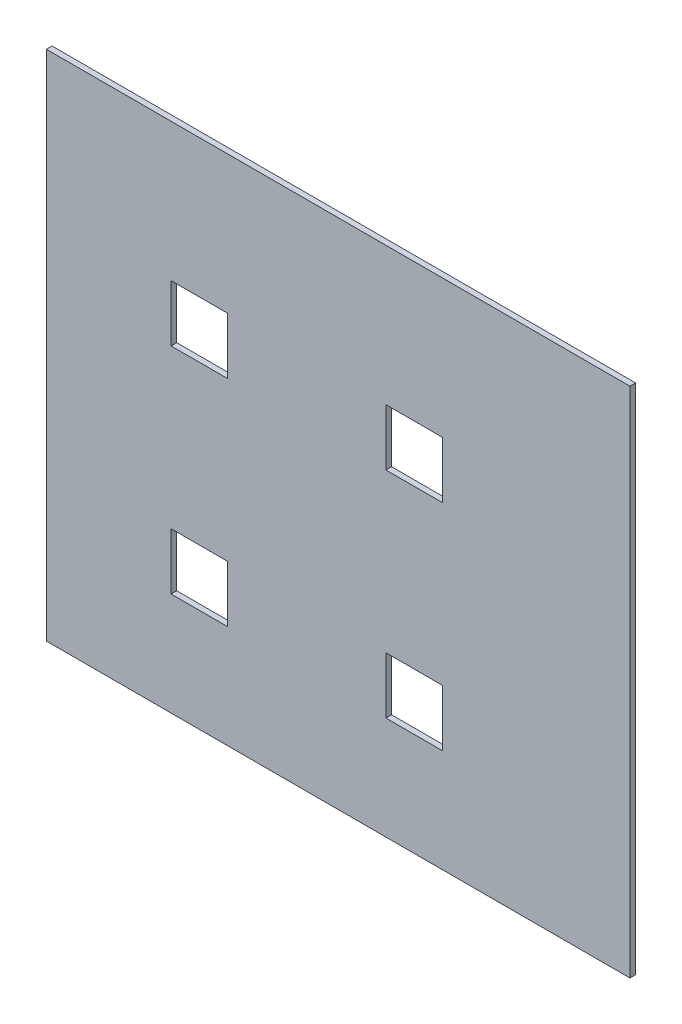
ISO-10303-21;
HEADER;
FILE_DESCRIPTION(('STEP AP214'),'2;1');
FILE_NAME('part.step','',(''),(''),'','','');
FILE_SCHEMA(('AUTOMOTIVE_DESIGN { 1 0 10303 214 1 1 1 1 }'));
ENDSEC;
DATA;
#1=APPLICATION_CONTEXT('core data for automotive mechanical design processes');
#2=APPLICATION_PROTOCOL_DEFINITION('international standard','automotive_design',2000,#1);
#3=PRODUCT_CONTEXT('',#1,'mechanical');
#4=PRODUCT('Part','Part','',(#3));
#5=PRODUCT_RELATED_PRODUCT_CATEGORY('part','',(#4));
#6=PRODUCT_DEFINITION_FORMATION('','',#4);
#7=PRODUCT_DEFINITION_CONTEXT('part definition',#1,'design');
#8=PRODUCT_DEFINITION('design','',#6,#7);
#9=PRODUCT_DEFINITION_SHAPE('','',#8);
#10=(LENGTH_UNIT() NAMED_UNIT(*) SI_UNIT(.MILLI.,.METRE.));
#11=(NAMED_UNIT(*) PLANE_ANGLE_UNIT() SI_UNIT($,.RADIAN.));
#12=(NAMED_UNIT(*) SI_UNIT($,.STERADIAN.) SOLID_ANGLE_UNIT());
#13=UNCERTAINTY_MEASURE_WITH_UNIT(LENGTH_MEASURE(1.E-05),#10,'distance_accuracy_value','');
#14=(GEOMETRIC_REPRESENTATION_CONTEXT(3) GLOBAL_UNCERTAINTY_ASSIGNED_CONTEXT((#13)) GLOBAL_UNIT_ASSIGNED_CONTEXT((#10,
#11,#12)) REPRESENTATION_CONTEXT('',''));
#15=CARTESIAN_POINT('',(0.,0.,0.));
#16=DIRECTION('',(0.,0.,1.));
#17=DIRECTION('',(1.,0.,0.));
#18=AXIS2_PLACEMENT_3D('',#15,#16,#17);
#19=CARTESIAN_POINT('',(0.,0.,1.));
#20=DIRECTION('',(0.,0.,1.));
#21=DIRECTION('',(1.,0.,0.));
#22=AXIS2_PLACEMENT_3D('',#19,#20,#21);
#23=PLANE('',#22);
#24=DIRECTION('',(0.,-1.,0.));
#25=VECTOR('',#24,1.);
#26=CARTESIAN_POINT('',(-22.0490408347482,72.417950797242,1.));
#27=LINE('',#26,#25);
#28=CARTESIAN_POINT('',(-22.0490408347482,72.417950797242,1.));
#29=VERTEX_POINT('',#28);
#30=CARTESIAN_POINT('',(-22.0490408347482,-18.2372017055102,1.));
#31=VERTEX_POINT('',#30);
#32=EDGE_CURVE('E299',#29,#31,#27,.T.);
#33=ORIENTED_EDGE('',*,*,#32,.T.);
#34=DIRECTION('',(1.,0.,0.));
#35=VECTOR('',#34,1.);
#36=CARTESIAN_POINT('',(-22.0490408347482,-18.2372017055102,1.));
#37=LINE('',#36,#35);
#38=CARTESIAN_POINT('',(81.1644011921947,-18.2372017055102,1.));
#39=VERTEX_POINT('',#38);
#40=EDGE_CURVE('E302',#31,#39,#37,.T.);
#41=ORIENTED_EDGE('',*,*,#40,.T.);
#42=DIRECTION('',(0.,1.,0.));
#43=VECTOR('',#42,1.);
#44=CARTESIAN_POINT('',(81.1644011921947,72.417950797242,1.));
#45=LINE('',#44,#43);
#46=CARTESIAN_POINT('',(81.1644011921947,72.417950797242,1.));
#47=VERTEX_POINT('',#46);
#48=EDGE_CURVE('E305',#39,#47,#45,.T.);
#49=ORIENTED_EDGE('',*,*,#48,.T.);
#50=DIRECTION('',(-1.,0.,0.));
#51=VECTOR('',#50,1.);
#52=CARTESIAN_POINT('',(-22.0490408347482,72.417950797242,1.));
#53=LINE('',#52,#51);
#54=EDGE_CURVE('E307',#47,#29,#53,.T.);
#55=ORIENTED_EDGE('',*,*,#54,.T.);
#56=EDGE_LOOP('',(#33,#41,#49,#55));
#57=FACE_BOUND('',#56,.T.);
#58=DIRECTION('',(1.,0.,0.));
#59=VECTOR('',#58,1.);
#60=CARTESIAN_POINT('',(0.,0.,1.));
#61=LINE('',#60,#59);
#62=CARTESIAN_POINT('',(0.,0.,1.));
#63=VERTEX_POINT('',#62);
#64=CARTESIAN_POINT('',(10.,0.,1.));
#65=VERTEX_POINT('',#64);
#66=EDGE_CURVE('E270',#63,#65,#61,.T.);
#67=ORIENTED_EDGE('',*,*,#66,.F.);
#68=DIRECTION('',(0.,-1.,0.));
#69=VECTOR('',#68,1.);
#70=CARTESIAN_POINT('',(0.,0.,1.));
#71=LINE('',#70,#69);
#72=CARTESIAN_POINT('',(0.,10.,1.));
#73=VERTEX_POINT('',#72);
#74=EDGE_CURVE('E268',#73,#63,#71,.T.);
#75=ORIENTED_EDGE('',*,*,#74,.F.);
#76=DIRECTION('',(-1.,0.,0.));
#77=VECTOR('',#76,1.);
#78=CARTESIAN_POINT('',(0.,10.,1.));
#79=LINE('',#78,#77);
#80=CARTESIAN_POINT('',(10.,10.,1.));
#81=VERTEX_POINT('',#80);
#82=EDGE_CURVE('E276',#81,#73,#79,.T.);
#83=ORIENTED_EDGE('',*,*,#82,.F.);
#84=DIRECTION('',(0.,1.,0.));
#85=VECTOR('',#84,1.);
#86=CARTESIAN_POINT('',(10.,0.,1.));
#87=LINE('',#86,#85);
#88=EDGE_CURVE('E273',#65,#81,#87,.T.);
#89=ORIENTED_EDGE('',*,*,#88,.F.);
#90=EDGE_LOOP('',(#67,#75,#83,#89));
#91=FACE_BOUND('',#90,.T.);
#92=DIRECTION('',(1.,0.,0.));
#93=VECTOR('',#92,1.);
#94=CARTESIAN_POINT('',(38.,0.,1.));
#95=LINE('',#94,#93);
#96=CARTESIAN_POINT('',(38.,0.,1.));
#97=VERTEX_POINT('',#96);
#98=CARTESIAN_POINT('',(48.,0.,1.));
#99=VERTEX_POINT('',#98);
#100=EDGE_CURVE('E239',#97,#99,#95,.T.);
#101=ORIENTED_EDGE('',*,*,#100,.F.);
#102=DIRECTION('',(0.,-1.,0.));
#103=VECTOR('',#102,1.);
#104=CARTESIAN_POINT('',(38.,0.,1.));
#105=LINE('',#104,#103);
#106=CARTESIAN_POINT('',(38.,10.,1.));
#107=VERTEX_POINT('',#106);
#108=EDGE_CURVE('E237',#107,#97,#105,.T.);
#109=ORIENTED_EDGE('',*,*,#108,.F.);
#110=DIRECTION('',(-1.,0.,0.));
#111=VECTOR('',#110,1.);
#112=CARTESIAN_POINT('',(38.,10.,1.));
#113=LINE('',#112,#111);
#114=CARTESIAN_POINT('',(48.,10.,1.));
#115=VERTEX_POINT('',#114);
#116=EDGE_CURVE('E245',#115,#107,#113,.T.);
#117=ORIENTED_EDGE('',*,*,#116,.F.);
#118=DIRECTION('',(0.,1.,0.));
#119=VECTOR('',#118,1.);
#120=CARTESIAN_POINT('',(48.,0.,1.));
#121=LINE('',#120,#119);
#122=EDGE_CURVE('E242',#99,#115,#121,.T.);
#123=ORIENTED_EDGE('',*,*,#122,.F.);
#124=EDGE_LOOP('',(#101,#109,#117,#123));
#125=FACE_BOUND('',#124,.T.);
#126=DIRECTION('',(1.,0.,0.));
#127=VECTOR('',#126,1.);
#128=CARTESIAN_POINT('',(38.,38.,1.));
#129=LINE('',#128,#127);
#130=CARTESIAN_POINT('',(38.,38.,1.));
#131=VERTEX_POINT('',#130);
#132=CARTESIAN_POINT('',(48.,38.,1.));
#133=VERTEX_POINT('',#132);
#134=EDGE_CURVE('E208',#131,#133,#129,.T.);
#135=ORIENTED_EDGE('',*,*,#134,.F.);
#136=DIRECTION('',(0.,-1.,0.));
#137=VECTOR('',#136,1.);
#138=CARTESIAN_POINT('',(38.,38.,1.));
#139=LINE('',#138,#137);
#140=CARTESIAN_POINT('',(38.,48.,1.));
#141=VERTEX_POINT('',#140);
#142=EDGE_CURVE('E206',#141,#131,#139,.T.);
#143=ORIENTED_EDGE('',*,*,#142,.F.);
#144=DIRECTION('',(-1.,0.,0.));
#145=VECTOR('',#144,1.);
#146=CARTESIAN_POINT('',(38.,48.,1.));
#147=LINE('',#146,#145);
#148=CARTESIAN_POINT('',(48.,48.,1.));
#149=VERTEX_POINT('',#148);
#150=EDGE_CURVE('E214',#149,#141,#147,.T.);
#151=ORIENTED_EDGE('',*,*,#150,.F.);
#152=DIRECTION('',(0.,1.,0.));
#153=VECTOR('',#152,1.);
#154=CARTESIAN_POINT('',(48.,38.,1.));
#155=LINE('',#154,#153);
#156=EDGE_CURVE('E211',#133,#149,#155,.T.);
#157=ORIENTED_EDGE('',*,*,#156,.F.);
#158=EDGE_LOOP('',(#135,#143,#151,#157));
#159=FACE_BOUND('',#158,.T.);
#160=DIRECTION('',(1.,0.,0.));
#161=VECTOR('',#160,1.);
#162=CARTESIAN_POINT('',(0.,38.,1.));
#163=LINE('',#162,#161);
#164=CARTESIAN_POINT('',(0.,38.,1.));
#165=VERTEX_POINT('',#164);
#166=CARTESIAN_POINT('',(10.,38.,1.));
#167=VERTEX_POINT('',#166);
#168=EDGE_CURVE('E178',#165,#167,#163,.T.);
#169=ORIENTED_EDGE('',*,*,#168,.F.);
#170=DIRECTION('',(0.,-1.,0.));
#171=VECTOR('',#170,1.);
#172=CARTESIAN_POINT('',(0.,38.,1.));
#173=LINE('',#172,#171);
#174=CARTESIAN_POINT('',(0.,48.,1.));
#175=VERTEX_POINT('',#174);
#176=EDGE_CURVE('E170',#175,#165,#173,.T.);
#177=ORIENTED_EDGE('',*,*,#176,.F.);
#178=DIRECTION('',(-1.,0.,0.));
#179=VECTOR('',#178,1.);
#180=CARTESIAN_POINT('',(0.,48.,1.));
#181=LINE('',#180,#179);
#182=CARTESIAN_POINT('',(10.,48.,1.));
#183=VERTEX_POINT('',#182);
#184=EDGE_CURVE('E192',#183,#175,#181,.T.);
#185=ORIENTED_EDGE('',*,*,#184,.F.);
#186=DIRECTION('',(0.,1.,0.));
#187=VECTOR('',#186,1.);
#188=CARTESIAN_POINT('',(10.,38.,1.));
#189=LINE('',#188,#187);
#190=EDGE_CURVE('E190',#167,#183,#189,.T.);
#191=ORIENTED_EDGE('',*,*,#190,.F.);
#192=EDGE_LOOP('',(#169,#177,#185,#191));
#193=FACE_BOUND('',#192,.T.);
#194=ADVANCED_FACE('F33',(#57,#91,#125,#159,#193),#23,.T.);
#195=CARTESIAN_POINT('',(0.,0.,0.));
#196=DIRECTION('',(0.,0.,1.));
#197=DIRECTION('',(1.,0.,0.));
#198=AXIS2_PLACEMENT_3D('',#195,#196,#197);
#199=PLANE('',#198);
#200=DIRECTION('',(0.,-1.,0.));
#201=VECTOR('',#200,1.);
#202=CARTESIAN_POINT('',(38.,38.,0.));
#203=LINE('',#202,#201);
#204=CARTESIAN_POINT('',(38.,48.,0.));
#205=VERTEX_POINT('',#204);
#206=CARTESIAN_POINT('',(38.,38.,0.));
#207=VERTEX_POINT('',#206);
#208=EDGE_CURVE('E186',#205,#207,#203,.T.);
#209=ORIENTED_EDGE('',*,*,#208,.T.);
#210=DIRECTION('',(1.,0.,0.));
#211=VECTOR('',#210,1.);
#212=CARTESIAN_POINT('',(38.,38.,0.));
#213=LINE('',#212,#211);
#214=CARTESIAN_POINT('',(48.,38.,0.));
#215=VERTEX_POINT('',#214);
#216=EDGE_CURVE('E219',#207,#215,#213,.T.);
#217=ORIENTED_EDGE('',*,*,#216,.T.);
#218=DIRECTION('',(0.,1.,0.));
#219=VECTOR('',#218,1.);
#220=CARTESIAN_POINT('',(48.,38.,0.));
#221=LINE('',#220,#219);
#222=CARTESIAN_POINT('',(48.,48.,0.));
#223=VERTEX_POINT('',#222);
#224=EDGE_CURVE('E222',#215,#223,#221,.T.);
#225=ORIENTED_EDGE('',*,*,#224,.T.);
#226=DIRECTION('',(-1.,0.,0.));
#227=VECTOR('',#226,1.);
#228=CARTESIAN_POINT('',(38.,48.,0.));
#229=LINE('',#228,#227);
#230=EDGE_CURVE('E209',#223,#205,#229,.T.);
#231=ORIENTED_EDGE('',*,*,#230,.T.);
#232=EDGE_LOOP('',(#209,#217,#225,#231));
#233=FACE_BOUND('',#232,.T.);
#234=DIRECTION('',(0.,-1.,0.));
#235=VECTOR('',#234,1.);
#236=CARTESIAN_POINT('',(0.,0.,0.));
#237=LINE('',#236,#235);
#238=CARTESIAN_POINT('',(0.,10.,0.));
#239=VERTEX_POINT('',#238);
#240=CARTESIAN_POINT('',(0.,0.,0.));
#241=VERTEX_POINT('',#240);
#242=EDGE_CURVE('E267',#239,#241,#237,.T.);
#243=ORIENTED_EDGE('',*,*,#242,.T.);
#244=DIRECTION('',(1.,0.,0.));
#245=VECTOR('',#244,1.);
#246=CARTESIAN_POINT('',(0.,0.,0.));
#247=LINE('',#246,#245);
#248=CARTESIAN_POINT('',(10.,0.,0.));
#249=VERTEX_POINT('',#248);
#250=EDGE_CURVE('E281',#241,#249,#247,.T.);
#251=ORIENTED_EDGE('',*,*,#250,.T.);
#252=DIRECTION('',(0.,1.,0.));
#253=VECTOR('',#252,1.);
#254=CARTESIAN_POINT('',(10.,0.,0.));
#255=LINE('',#254,#253);
#256=CARTESIAN_POINT('',(10.,10.,0.));
#257=VERTEX_POINT('',#256);
#258=EDGE_CURVE('E284',#249,#257,#255,.T.);
#259=ORIENTED_EDGE('',*,*,#258,.T.);
#260=DIRECTION('',(-1.,0.,0.));
#261=VECTOR('',#260,1.);
#262=CARTESIAN_POINT('',(0.,10.,0.));
#263=LINE('',#262,#261);
#264=EDGE_CURVE('E271',#257,#239,#263,.T.);
#265=ORIENTED_EDGE('',*,*,#264,.T.);
#266=EDGE_LOOP('',(#243,#251,#259,#265));
#267=FACE_BOUND('',#266,.T.);
#268=DIRECTION('',(0.,-1.,0.));
#269=VECTOR('',#268,1.);
#270=CARTESIAN_POINT('',(-22.0490408347482,72.417950797242,0.));
#271=LINE('',#270,#269);
#272=CARTESIAN_POINT('',(-22.0490408347482,72.417950797242,0.));
#273=VERTEX_POINT('',#272);
#274=CARTESIAN_POINT('',(-22.0490408347482,-18.2372017055102,0.));
#275=VERTEX_POINT('',#274);
#276=EDGE_CURVE('E298',#273,#275,#271,.T.);
#277=ORIENTED_EDGE('',*,*,#276,.F.);
#278=DIRECTION('',(-1.,0.,0.));
#279=VECTOR('',#278,1.);
#280=CARTESIAN_POINT('',(-22.0490408347482,72.417950797242,0.));
#281=LINE('',#280,#279);
#282=CARTESIAN_POINT('',(81.1644011921947,72.417950797242,0.));
#283=VERTEX_POINT('',#282);
#284=EDGE_CURVE('E303',#283,#273,#281,.T.);
#285=ORIENTED_EDGE('',*,*,#284,.F.);
#286=DIRECTION('',(0.,1.,0.));
#287=VECTOR('',#286,1.);
#288=CARTESIAN_POINT('',(81.1644011921947,72.417950797242,0.));
#289=LINE('',#288,#287);
#290=CARTESIAN_POINT('',(81.1644011921947,-18.2372017055102,0.));
#291=VERTEX_POINT('',#290);
#292=EDGE_CURVE('E314',#291,#283,#289,.T.);
#293=ORIENTED_EDGE('',*,*,#292,.F.);
#294=DIRECTION('',(1.,0.,0.));
#295=VECTOR('',#294,1.);
#296=CARTESIAN_POINT('',(-22.0490408347482,-18.2372017055102,0.));
#297=LINE('',#296,#295);
#298=EDGE_CURVE('E312',#275,#291,#297,.T.);
#299=ORIENTED_EDGE('',*,*,#298,.F.);
#300=EDGE_LOOP('',(#277,#285,#293,#299));
#301=FACE_BOUND('',#300,.T.);
#302=DIRECTION('',(0.,-1.,0.));
#303=VECTOR('',#302,1.);
#304=CARTESIAN_POINT('',(38.,0.,0.));
#305=LINE('',#304,#303);
#306=CARTESIAN_POINT('',(38.,10.,0.));
#307=VERTEX_POINT('',#306);
#308=CARTESIAN_POINT('',(38.,0.,0.));
#309=VERTEX_POINT('',#308);
#310=EDGE_CURVE('E236',#307,#309,#305,.T.);
#311=ORIENTED_EDGE('',*,*,#310,.T.);
#312=DIRECTION('',(1.,0.,0.));
#313=VECTOR('',#312,1.);
#314=CARTESIAN_POINT('',(38.,0.,0.));
#315=LINE('',#314,#313);
#316=CARTESIAN_POINT('',(48.,0.,0.));
#317=VERTEX_POINT('',#316);
#318=EDGE_CURVE('E250',#309,#317,#315,.T.);
#319=ORIENTED_EDGE('',*,*,#318,.T.);
#320=DIRECTION('',(0.,1.,0.));
#321=VECTOR('',#320,1.);
#322=CARTESIAN_POINT('',(48.,0.,0.));
#323=LINE('',#322,#321);
#324=CARTESIAN_POINT('',(48.,10.,0.));
#325=VERTEX_POINT('',#324);
#326=EDGE_CURVE('E253',#317,#325,#323,.T.);
#327=ORIENTED_EDGE('',*,*,#326,.T.);
#328=DIRECTION('',(-1.,0.,0.));
#329=VECTOR('',#328,1.);
#330=CARTESIAN_POINT('',(38.,10.,0.));
#331=LINE('',#330,#329);
#332=EDGE_CURVE('E240',#325,#307,#331,.T.);
#333=ORIENTED_EDGE('',*,*,#332,.T.);
#334=EDGE_LOOP('',(#311,#319,#327,#333));
#335=FACE_BOUND('',#334,.T.);
#336=DIRECTION('',(0.,-1.,0.));
#337=VECTOR('',#336,1.);
#338=CARTESIAN_POINT('',(0.,38.,0.));
#339=LINE('',#338,#337);
#340=CARTESIAN_POINT('',(0.,48.,0.));
#341=VERTEX_POINT('',#340);
#342=CARTESIAN_POINT('',(0.,38.,0.));
#343=VERTEX_POINT('',#342);
#344=EDGE_CURVE('E56',#341,#343,#339,.T.);
#345=ORIENTED_EDGE('',*,*,#344,.T.);
#346=DIRECTION('',(1.,0.,0.));
#347=VECTOR('',#346,1.);
#348=CARTESIAN_POINT('',(0.,38.,0.));
#349=LINE('',#348,#347);
#350=CARTESIAN_POINT('',(10.,38.,0.));
#351=VERTEX_POINT('',#350);
#352=EDGE_CURVE('E185',#343,#351,#349,.T.);
#353=ORIENTED_EDGE('',*,*,#352,.T.);
#354=DIRECTION('',(0.,1.,0.));
#355=VECTOR('',#354,1.);
#356=CARTESIAN_POINT('',(10.,38.,0.));
#357=LINE('',#356,#355);
#358=CARTESIAN_POINT('',(10.,48.,0.));
#359=VERTEX_POINT('',#358);
#360=EDGE_CURVE('E198',#351,#359,#357,.T.);
#361=ORIENTED_EDGE('',*,*,#360,.T.);
#362=DIRECTION('',(-1.,0.,0.));
#363=VECTOR('',#362,1.);
#364=CARTESIAN_POINT('',(0.,48.,0.));
#365=LINE('',#364,#363);
#366=EDGE_CURVE('E179',#359,#341,#365,.T.);
#367=ORIENTED_EDGE('',*,*,#366,.T.);
#368=EDGE_LOOP('',(#345,#353,#361,#367));
#369=FACE_BOUND('',#368,.T.);
#370=ADVANCED_FACE('F332',(#233,#267,#301,#335,#369),#199,.F.);
#371=CARTESIAN_POINT('',(-22.0490408347482,72.417950797242,1.));
#372=DIRECTION('',(1.,0.,0.));
#373=DIRECTION('',(0.,0.,-1.));
#374=AXIS2_PLACEMENT_3D('',#371,#372,#373);
#375=PLANE('',#374);
#376=ORIENTED_EDGE('',*,*,#276,.T.);
#377=DIRECTION('',(0.,0.,-1.));
#378=VECTOR('',#377,1.);
#379=CARTESIAN_POINT('',(-22.0490408347482,-18.2372017055102,1.));
#380=LINE('',#379,#378);
#381=EDGE_CURVE('E11',#31,#275,#380,.T.);
#382=ORIENTED_EDGE('',*,*,#381,.F.);
#383=ORIENTED_EDGE('',*,*,#32,.F.);
#384=DIRECTION('',(0.,0.,-1.));
#385=VECTOR('',#384,1.);
#386=CARTESIAN_POINT('',(-22.0490408347482,72.417950797242,1.));
#387=LINE('',#386,#385);
#388=EDGE_CURVE('E309',#29,#273,#387,.T.);
#389=ORIENTED_EDGE('',*,*,#388,.T.);
#390=EDGE_LOOP('',(#376,#382,#383,#389));
#391=FACE_BOUND('',#390,.T.);
#392=ADVANCED_FACE('F35',(#391),#375,.F.);
#393=CARTESIAN_POINT('',(-22.0490408347482,-18.2372017055102,1.));
#394=DIRECTION('',(0.,1.,0.));
#395=DIRECTION('',(0.,0.,1.));
#396=AXIS2_PLACEMENT_3D('',#393,#394,#395);
#397=PLANE('',#396);
#398=ORIENTED_EDGE('',*,*,#298,.T.);
#399=DIRECTION('',(0.,0.,-1.));
#400=VECTOR('',#399,1.);
#401=CARTESIAN_POINT('',(81.1644011921947,-18.2372017055102,1.));
#402=LINE('',#401,#400);
#403=EDGE_CURVE('E41',#39,#291,#402,.T.);
#404=ORIENTED_EDGE('',*,*,#403,.F.);
#405=ORIENTED_EDGE('',*,*,#40,.F.);
#406=ORIENTED_EDGE('',*,*,#381,.T.);
#407=EDGE_LOOP('',(#398,#404,#405,#406));
#408=FACE_BOUND('',#407,.T.);
#409=ADVANCED_FACE('F343',(#408),#397,.F.);
#410=CARTESIAN_POINT('',(81.1644011921947,72.417950797242,1.));
#411=DIRECTION('',(-1.,0.,0.));
#412=DIRECTION('',(0.,0.,1.));
#413=AXIS2_PLACEMENT_3D('',#410,#411,#412);
#414=PLANE('',#413);
#415=ORIENTED_EDGE('',*,*,#292,.T.);
#416=DIRECTION('',(0.,0.,-1.));
#417=VECTOR('',#416,1.);
#418=CARTESIAN_POINT('',(81.1644011921947,72.417950797242,1.));
#419=LINE('',#418,#417);
#420=EDGE_CURVE('E319',#47,#283,#419,.T.);
#421=ORIENTED_EDGE('',*,*,#420,.F.);
#422=ORIENTED_EDGE('',*,*,#48,.F.);
#423=ORIENTED_EDGE('',*,*,#403,.T.);
#424=EDGE_LOOP('',(#415,#421,#422,#423));
#425=FACE_BOUND('',#424,.T.);
#426=ADVANCED_FACE('F326',(#425),#414,.F.);
#427=CARTESIAN_POINT('',(-22.0490408347482,72.417950797242,1.));
#428=DIRECTION('',(0.,-1.,0.));
#429=DIRECTION('',(0.,0.,-1.));
#430=AXIS2_PLACEMENT_3D('',#427,#428,#429);
#431=PLANE('',#430);
#432=ORIENTED_EDGE('',*,*,#284,.T.);
#433=ORIENTED_EDGE('',*,*,#388,.F.);
#434=ORIENTED_EDGE('',*,*,#54,.F.);
#435=ORIENTED_EDGE('',*,*,#420,.T.);
#436=EDGE_LOOP('',(#432,#433,#434,#435));
#437=FACE_BOUND('',#436,.T.);
#438=ADVANCED_FACE('F336',(#437),#431,.F.);
#439=CARTESIAN_POINT('',(0.,0.,1.));
#440=DIRECTION('',(1.,0.,0.));
#441=DIRECTION('',(0.,0.,-1.));
#442=AXIS2_PLACEMENT_3D('',#439,#440,#441);
#443=PLANE('',#442);
#444=ORIENTED_EDGE('',*,*,#242,.F.);
#445=DIRECTION('',(0.,0.,-1.));
#446=VECTOR('',#445,1.);
#447=CARTESIAN_POINT('',(0.,10.,1.));
#448=LINE('',#447,#446);
#449=EDGE_CURVE('E278',#73,#239,#448,.T.);
#450=ORIENTED_EDGE('',*,*,#449,.F.);
#451=ORIENTED_EDGE('',*,*,#74,.T.);
#452=DIRECTION('',(0.,0.,-1.));
#453=VECTOR('',#452,1.);
#454=CARTESIAN_POINT('',(0.,0.,1.));
#455=LINE('',#454,#453);
#456=EDGE_CURVE('E295',#63,#241,#455,.T.);
#457=ORIENTED_EDGE('',*,*,#456,.T.);
#458=EDGE_LOOP('',(#444,#450,#451,#457));
#459=FACE_BOUND('',#458,.T.);
#460=ADVANCED_FACE('F358',(#459),#443,.T.);
#461=CARTESIAN_POINT('',(0.,0.,1.));
#462=DIRECTION('',(0.,1.,0.));
#463=DIRECTION('',(0.,0.,1.));
#464=AXIS2_PLACEMENT_3D('',#461,#462,#463);
#465=PLANE('',#464);
#466=ORIENTED_EDGE('',*,*,#250,.F.);
#467=ORIENTED_EDGE('',*,*,#456,.F.);
#468=ORIENTED_EDGE('',*,*,#66,.T.);
#469=DIRECTION('',(0.,0.,-1.));
#470=VECTOR('',#469,1.);
#471=CARTESIAN_POINT('',(10.,0.,1.));
#472=LINE('',#471,#470);
#473=EDGE_CURVE('E293',#65,#249,#472,.T.);
#474=ORIENTED_EDGE('',*,*,#473,.T.);
#475=EDGE_LOOP('',(#466,#467,#468,#474));
#476=FACE_BOUND('',#475,.T.);
#477=ADVANCED_FACE('F365',(#476),#465,.T.);
#478=CARTESIAN_POINT('',(10.,0.,1.));
#479=DIRECTION('',(-1.,0.,0.));
#480=DIRECTION('',(0.,0.,1.));
#481=AXIS2_PLACEMENT_3D('',#478,#479,#480);
#482=PLANE('',#481);
#483=ORIENTED_EDGE('',*,*,#258,.F.);
#484=ORIENTED_EDGE('',*,*,#473,.F.);
#485=ORIENTED_EDGE('',*,*,#88,.T.);
#486=DIRECTION('',(0.,0.,-1.));
#487=VECTOR('',#486,1.);
#488=CARTESIAN_POINT('',(10.,10.,1.));
#489=LINE('',#488,#487);
#490=EDGE_CURVE('E291',#81,#257,#489,.T.);
#491=ORIENTED_EDGE('',*,*,#490,.T.);
#492=EDGE_LOOP('',(#483,#484,#485,#491));
#493=FACE_BOUND('',#492,.T.);
#494=ADVANCED_FACE('F370',(#493),#482,.T.);
#495=CARTESIAN_POINT('',(0.,10.,1.));
#496=DIRECTION('',(0.,-1.,0.));
#497=DIRECTION('',(0.,0.,-1.));
#498=AXIS2_PLACEMENT_3D('',#495,#496,#497);
#499=PLANE('',#498);
#500=ORIENTED_EDGE('',*,*,#264,.F.);
#501=ORIENTED_EDGE('',*,*,#490,.F.);
#502=ORIENTED_EDGE('',*,*,#82,.T.);
#503=ORIENTED_EDGE('',*,*,#449,.T.);
#504=EDGE_LOOP('',(#500,#501,#502,#503));
#505=FACE_BOUND('',#504,.T.);
#506=ADVANCED_FACE('F378',(#505),#499,.T.);
#507=CARTESIAN_POINT('',(38.,0.,1.));
#508=DIRECTION('',(1.,0.,0.));
#509=DIRECTION('',(0.,0.,-1.));
#510=AXIS2_PLACEMENT_3D('',#507,#508,#509);
#511=PLANE('',#510);
#512=ORIENTED_EDGE('',*,*,#310,.F.);
#513=DIRECTION('',(0.,0.,-1.));
#514=VECTOR('',#513,1.);
#515=CARTESIAN_POINT('',(38.,10.,1.));
#516=LINE('',#515,#514);
#517=EDGE_CURVE('E247',#107,#307,#516,.T.);
#518=ORIENTED_EDGE('',*,*,#517,.F.);
#519=ORIENTED_EDGE('',*,*,#108,.T.);
#520=DIRECTION('',(0.,0.,-1.));
#521=VECTOR('',#520,1.);
#522=CARTESIAN_POINT('',(38.,0.,1.));
#523=LINE('',#522,#521);
#524=EDGE_CURVE('E264',#97,#309,#523,.T.);
#525=ORIENTED_EDGE('',*,*,#524,.T.);
#526=EDGE_LOOP('',(#512,#518,#519,#525));
#527=FACE_BOUND('',#526,.T.);
#528=ADVANCED_FACE('F432',(#527),#511,.T.);
#529=CARTESIAN_POINT('',(38.,0.,1.));
#530=DIRECTION('',(0.,1.,0.));
#531=DIRECTION('',(0.,0.,1.));
#532=AXIS2_PLACEMENT_3D('',#529,#530,#531);
#533=PLANE('',#532);
#534=ORIENTED_EDGE('',*,*,#318,.F.);
#535=ORIENTED_EDGE('',*,*,#524,.F.);
#536=ORIENTED_EDGE('',*,*,#100,.T.);
#537=DIRECTION('',(0.,0.,-1.));
#538=VECTOR('',#537,1.);
#539=CARTESIAN_POINT('',(48.,0.,1.));
#540=LINE('',#539,#538);
#541=EDGE_CURVE('E262',#99,#317,#540,.T.);
#542=ORIENTED_EDGE('',*,*,#541,.T.);
#543=EDGE_LOOP('',(#534,#535,#536,#542));
#544=FACE_BOUND('',#543,.T.);
#545=ADVANCED_FACE('F428',(#544),#533,.T.);
#546=CARTESIAN_POINT('',(48.,0.,1.));
#547=DIRECTION('',(-1.,0.,0.));
#548=DIRECTION('',(0.,0.,1.));
#549=AXIS2_PLACEMENT_3D('',#546,#547,#548);
#550=PLANE('',#549);
#551=ORIENTED_EDGE('',*,*,#326,.F.);
#552=ORIENTED_EDGE('',*,*,#541,.F.);
#553=ORIENTED_EDGE('',*,*,#122,.T.);
#554=DIRECTION('',(0.,0.,-1.));
#555=VECTOR('',#554,1.);
#556=CARTESIAN_POINT('',(48.,10.,1.));
#557=LINE('',#556,#555);
#558=EDGE_CURVE('E260',#115,#325,#557,.T.);
#559=ORIENTED_EDGE('',*,*,#558,.T.);
#560=EDGE_LOOP('',(#551,#552,#553,#559));
#561=FACE_BOUND('',#560,.T.);
#562=ADVANCED_FACE('F424',(#561),#550,.T.);
#563=CARTESIAN_POINT('',(38.,10.,1.));
#564=DIRECTION('',(0.,-1.,0.));
#565=DIRECTION('',(0.,0.,-1.));
#566=AXIS2_PLACEMENT_3D('',#563,#564,#565);
#567=PLANE('',#566);
#568=ORIENTED_EDGE('',*,*,#332,.F.);
#569=ORIENTED_EDGE('',*,*,#558,.F.);
#570=ORIENTED_EDGE('',*,*,#116,.T.);
#571=ORIENTED_EDGE('',*,*,#517,.T.);
#572=EDGE_LOOP('',(#568,#569,#570,#571));
#573=FACE_BOUND('',#572,.T.);
#574=ADVANCED_FACE('F421',(#573),#567,.T.);
#575=CARTESIAN_POINT('',(38.,38.,1.));
#576=DIRECTION('',(1.,0.,0.));
#577=DIRECTION('',(0.,0.,-1.));
#578=AXIS2_PLACEMENT_3D('',#575,#576,#577);
#579=PLANE('',#578);
#580=ORIENTED_EDGE('',*,*,#208,.F.);
#581=DIRECTION('',(0.,0.,-1.));
#582=VECTOR('',#581,1.);
#583=CARTESIAN_POINT('',(38.,48.,1.));
#584=LINE('',#583,#582);
#585=EDGE_CURVE('E216',#141,#205,#584,.T.);
#586=ORIENTED_EDGE('',*,*,#585,.F.);
#587=ORIENTED_EDGE('',*,*,#142,.T.);
#588=DIRECTION('',(0.,0.,-1.));
#589=VECTOR('',#588,1.);
#590=CARTESIAN_POINT('',(38.,38.,1.));
#591=LINE('',#590,#589);
#592=EDGE_CURVE('E233',#131,#207,#591,.T.);
#593=ORIENTED_EDGE('',*,*,#592,.T.);
#594=EDGE_LOOP('',(#580,#586,#587,#593));
#595=FACE_BOUND('',#594,.T.);
#596=ADVANCED_FACE('F403',(#595),#579,.T.);
#597=CARTESIAN_POINT('',(38.,38.,1.));
#598=DIRECTION('',(0.,1.,0.));
#599=DIRECTION('',(0.,0.,1.));
#600=AXIS2_PLACEMENT_3D('',#597,#598,#599);
#601=PLANE('',#600);
#602=ORIENTED_EDGE('',*,*,#216,.F.);
#603=ORIENTED_EDGE('',*,*,#592,.F.);
#604=ORIENTED_EDGE('',*,*,#134,.T.);
#605=DIRECTION('',(0.,0.,-1.));
#606=VECTOR('',#605,1.);
#607=CARTESIAN_POINT('',(48.,38.,1.));
#608=LINE('',#607,#606);
#609=EDGE_CURVE('E231',#133,#215,#608,.T.);
#610=ORIENTED_EDGE('',*,*,#609,.T.);
#611=EDGE_LOOP('',(#602,#603,#604,#610));
#612=FACE_BOUND('',#611,.T.);
#613=ADVANCED_FACE('F397',(#612),#601,.T.);
#614=CARTESIAN_POINT('',(48.,38.,1.));
#615=DIRECTION('',(-1.,0.,0.));
#616=DIRECTION('',(0.,0.,1.));
#617=AXIS2_PLACEMENT_3D('',#614,#615,#616);
#618=PLANE('',#617);
#619=ORIENTED_EDGE('',*,*,#224,.F.);
#620=ORIENTED_EDGE('',*,*,#609,.F.);
#621=ORIENTED_EDGE('',*,*,#156,.T.);
#622=DIRECTION('',(0.,0.,-1.));
#623=VECTOR('',#622,1.);
#624=CARTESIAN_POINT('',(48.,48.,1.));
#625=LINE('',#624,#623);
#626=EDGE_CURVE('E229',#149,#223,#625,.T.);
#627=ORIENTED_EDGE('',*,*,#626,.T.);
#628=EDGE_LOOP('',(#619,#620,#621,#627));
#629=FACE_BOUND('',#628,.T.);
#630=ADVANCED_FACE('F400',(#629),#618,.T.);
#631=CARTESIAN_POINT('',(38.,48.,1.));
#632=DIRECTION('',(0.,-1.,0.));
#633=DIRECTION('',(0.,0.,-1.));
#634=AXIS2_PLACEMENT_3D('',#631,#632,#633);
#635=PLANE('',#634);
#636=ORIENTED_EDGE('',*,*,#230,.F.);
#637=ORIENTED_EDGE('',*,*,#626,.F.);
#638=ORIENTED_EDGE('',*,*,#150,.T.);
#639=ORIENTED_EDGE('',*,*,#585,.T.);
#640=EDGE_LOOP('',(#636,#637,#638,#639));
#641=FACE_BOUND('',#640,.T.);
#642=ADVANCED_FACE('F406',(#641),#635,.T.);
#643=CARTESIAN_POINT('',(0.,38.,1.));
#644=DIRECTION('',(1.,0.,0.));
#645=DIRECTION('',(0.,0.,-1.));
#646=AXIS2_PLACEMENT_3D('',#643,#644,#645);
#647=PLANE('',#646);
#648=ORIENTED_EDGE('',*,*,#344,.F.);
#649=DIRECTION('',(0.,0.,-1.));
#650=VECTOR('',#649,1.);
#651=CARTESIAN_POINT('',(0.,48.,1.));
#652=LINE('',#651,#650);
#653=EDGE_CURVE('E174',#175,#341,#652,.T.);
#654=ORIENTED_EDGE('',*,*,#653,.F.);
#655=ORIENTED_EDGE('',*,*,#176,.T.);
#656=DIRECTION('',(0.,0.,-1.));
#657=VECTOR('',#656,1.);
#658=CARTESIAN_POINT('',(0.,38.,1.));
#659=LINE('',#658,#657);
#660=EDGE_CURVE('E173',#165,#343,#659,.T.);
#661=ORIENTED_EDGE('',*,*,#660,.T.);
#662=EDGE_LOOP('',(#648,#654,#655,#661));
#663=FACE_BOUND('',#662,.T.);
#664=ADVANCED_FACE('F172',(#663),#647,.T.);
#665=CARTESIAN_POINT('',(0.,38.,1.));
#666=DIRECTION('',(0.,1.,0.));
#667=DIRECTION('',(0.,0.,1.));
#668=AXIS2_PLACEMENT_3D('',#665,#666,#667);
#669=PLANE('',#668);
#670=ORIENTED_EDGE('',*,*,#352,.F.);
#671=ORIENTED_EDGE('',*,*,#660,.F.);
#672=ORIENTED_EDGE('',*,*,#168,.T.);
#673=DIRECTION('',(0.,0.,-1.));
#674=VECTOR('',#673,1.);
#675=CARTESIAN_POINT('',(10.,38.,1.));
#676=LINE('',#675,#674);
#677=EDGE_CURVE('E187',#167,#351,#676,.T.);
#678=ORIENTED_EDGE('',*,*,#677,.T.);
#679=EDGE_LOOP('',(#670,#671,#672,#678));
#680=FACE_BOUND('',#679,.T.);
#681=ADVANCED_FACE('F182',(#680),#669,.T.);
#682=CARTESIAN_POINT('',(10.,38.,1.));
#683=DIRECTION('',(-1.,0.,0.));
#684=DIRECTION('',(0.,0.,1.));
#685=AXIS2_PLACEMENT_3D('',#682,#683,#684);
#686=PLANE('',#685);
#687=ORIENTED_EDGE('',*,*,#360,.F.);
#688=ORIENTED_EDGE('',*,*,#677,.F.);
#689=ORIENTED_EDGE('',*,*,#190,.T.);
#690=DIRECTION('',(0.,0.,-1.));
#691=VECTOR('',#690,1.);
#692=CARTESIAN_POINT('',(10.,48.,1.));
#693=LINE('',#692,#691);
#694=EDGE_CURVE('E48',#183,#359,#693,.T.);
#695=ORIENTED_EDGE('',*,*,#694,.T.);
#696=EDGE_LOOP('',(#687,#688,#689,#695));
#697=FACE_BOUND('',#696,.T.);
#698=ADVANCED_FACE('F495',(#697),#686,.T.);
#699=CARTESIAN_POINT('',(0.,48.,1.));
#700=DIRECTION('',(0.,-1.,0.));
#701=DIRECTION('',(0.,0.,-1.));
#702=AXIS2_PLACEMENT_3D('',#699,#700,#701);
#703=PLANE('',#702);
#704=ORIENTED_EDGE('',*,*,#366,.F.);
#705=ORIENTED_EDGE('',*,*,#694,.F.);
#706=ORIENTED_EDGE('',*,*,#184,.T.);
#707=ORIENTED_EDGE('',*,*,#653,.T.);
#708=EDGE_LOOP('',(#704,#705,#706,#707));
#709=FACE_BOUND('',#708,.T.);
#710=ADVANCED_FACE('F503',(#709),#703,.T.);
#711=CLOSED_SHELL('',(#194,#370,#392,#409,#426,#438,#460,#477,#494,#506,#528,#545,#562,#574,
#596,#613,#630,#642,#664,#681,#698,#710));
#712=MANIFOLD_SOLID_BREP('B2',#711);
#713=ADVANCED_BREP_SHAPE_REPRESENTATION('',(#18,#712),#14);
#714=SHAPE_DEFINITION_REPRESENTATION(#9,#713);
ENDSEC;
END-ISO-10303-21;
